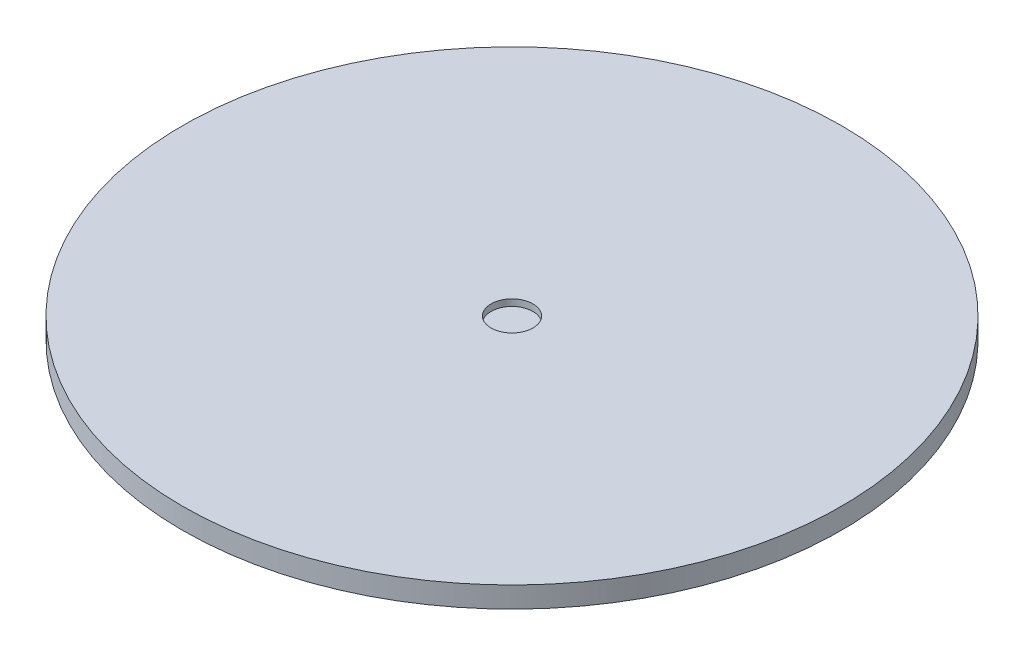
ISO-10303-21;
HEADER;
FILE_DESCRIPTION(('STEP AP214'),'2;1');
FILE_NAME('part.step','',(''),(''),'','','');
FILE_SCHEMA(('AUTOMOTIVE_DESIGN { 1 0 10303 214 1 1 1 1 }'));
ENDSEC;
DATA;
#1=APPLICATION_CONTEXT('core data for automotive mechanical design processes');
#2=APPLICATION_PROTOCOL_DEFINITION('international standard','automotive_design',2000,#1);
#3=PRODUCT_CONTEXT('',#1,'mechanical');
#4=PRODUCT('Part','Part','',(#3));
#5=PRODUCT_RELATED_PRODUCT_CATEGORY('part','',(#4));
#6=PRODUCT_DEFINITION_FORMATION('','',#4);
#7=PRODUCT_DEFINITION_CONTEXT('part definition',#1,'design');
#8=PRODUCT_DEFINITION('design','',#6,#7);
#9=PRODUCT_DEFINITION_SHAPE('','',#8);
#10=(LENGTH_UNIT() NAMED_UNIT(*) SI_UNIT(.MILLI.,.METRE.));
#11=(NAMED_UNIT(*) PLANE_ANGLE_UNIT() SI_UNIT($,.RADIAN.));
#12=(NAMED_UNIT(*) SI_UNIT($,.STERADIAN.) SOLID_ANGLE_UNIT());
#13=UNCERTAINTY_MEASURE_WITH_UNIT(LENGTH_MEASURE(1.E-05),#10,'distance_accuracy_value','');
#14=(GEOMETRIC_REPRESENTATION_CONTEXT(3) GLOBAL_UNCERTAINTY_ASSIGNED_CONTEXT((#13)) GLOBAL_UNIT_ASSIGNED_CONTEXT((#10,
#11,#12)) REPRESENTATION_CONTEXT('',''));
#15=CARTESIAN_POINT('',(0.,0.,0.));
#16=DIRECTION('',(0.,0.,1.));
#17=DIRECTION('',(1.,0.,0.));
#18=AXIS2_PLACEMENT_3D('',#15,#16,#17);
#19=CARTESIAN_POINT('',(0.,6.35,0.));
#20=DIRECTION('',(0.,-1.,0.));
#21=DIRECTION('',(0.,0.,-1.));
#22=AXIS2_PLACEMENT_3D('',#19,#20,#21);
#23=CYLINDRICAL_SURFACE('',#22,100.);
#24=CARTESIAN_POINT('',(0.,6.35,0.));
#25=DIRECTION('',(0.,1.,0.));
#26=DIRECTION('',(0.,0.,1.));
#27=AXIS2_PLACEMENT_3D('',#24,#25,#26);
#28=CIRCLE('',#27,100.);
#29=CARTESIAN_POINT('',(0.,6.35,100.));
#30=VERTEX_POINT('',#29);
#31=EDGE_CURVE('E10',#30,#30,#28,.T.);
#32=ORIENTED_EDGE('',*,*,#31,.F.);
#33=EDGE_LOOP('',(#32));
#34=FACE_BOUND('',#33,.T.);
#35=CARTESIAN_POINT('',(0.,0.,0.));
#36=DIRECTION('',(0.,1.,0.));
#37=DIRECTION('',(0.,0.,1.));
#38=AXIS2_PLACEMENT_3D('',#35,#36,#37);
#39=CIRCLE('',#38,100.);
#40=CARTESIAN_POINT('',(0.,0.,100.));
#41=VERTEX_POINT('',#40);
#42=EDGE_CURVE('E40',#41,#41,#39,.T.);
#43=ORIENTED_EDGE('',*,*,#42,.T.);
#44=EDGE_LOOP('',(#43));
#45=FACE_BOUND('',#44,.T.);
#46=ADVANCED_FACE('F37',(#34,#45),#23,.T.);
#47=CARTESIAN_POINT('',(0.,6.35,0.));
#48=DIRECTION('',(0.,1.,0.));
#49=DIRECTION('',(0.,0.,1.));
#50=AXIS2_PLACEMENT_3D('',#47,#48,#49);
#51=PLANE('',#50);
#52=CARTESIAN_POINT('',(0.,6.35,0.));
#53=DIRECTION('',(0.,1.,0.));
#54=DIRECTION('',(0.,0.,1.));
#55=AXIS2_PLACEMENT_3D('',#52,#53,#54);
#56=CIRCLE('',#55,6.35);
#57=CARTESIAN_POINT('',(0.,6.35,6.35));
#58=VERTEX_POINT('',#57);
#59=EDGE_CURVE('E51',#58,#58,#56,.T.);
#60=ORIENTED_EDGE('',*,*,#59,.F.);
#61=EDGE_LOOP('',(#60));
#62=FACE_BOUND('',#61,.T.);
#63=ORIENTED_EDGE('',*,*,#31,.T.);
#64=EDGE_LOOP('',(#63));
#65=FACE_BOUND('',#64,.T.);
#66=ADVANCED_FACE('F68',(#62,#65),#51,.T.);
#67=CARTESIAN_POINT('',(0.,0.,0.));
#68=DIRECTION('',(0.,1.,0.));
#69=DIRECTION('',(0.,0.,1.));
#70=AXIS2_PLACEMENT_3D('',#67,#68,#69);
#71=PLANE('',#70);
#72=ORIENTED_EDGE('',*,*,#42,.F.);
#73=EDGE_LOOP('',(#72));
#74=FACE_BOUND('',#73,.T.);
#75=ADVANCED_FACE('F64',(#74),#71,.F.);
#76=CARTESIAN_POINT('',(0.,4.35,0.));
#77=DIRECTION('',(0.,1.,0.));
#78=DIRECTION('',(0.,0.,1.));
#79=AXIS2_PLACEMENT_3D('',#76,#77,#78);
#80=CYLINDRICAL_SURFACE('',#79,6.35);
#81=CARTESIAN_POINT('',(0.,4.35,0.));
#82=DIRECTION('',(0.,1.,0.));
#83=DIRECTION('',(0.,0.,1.));
#84=AXIS2_PLACEMENT_3D('',#81,#82,#83);
#85=CIRCLE('',#84,6.35);
#86=CARTESIAN_POINT('',(0.,4.35,6.35));
#87=VERTEX_POINT('',#86);
#88=EDGE_CURVE('E49',#87,#87,#85,.T.);
#89=ORIENTED_EDGE('',*,*,#88,.F.);
#90=EDGE_LOOP('',(#89));
#91=FACE_BOUND('',#90,.T.);
#92=ORIENTED_EDGE('',*,*,#59,.T.);
#93=EDGE_LOOP('',(#92));
#94=FACE_BOUND('',#93,.T.);
#95=ADVANCED_FACE('F61',(#91,#94),#80,.F.);
#96=CARTESIAN_POINT('',(0.,4.35,0.));
#97=DIRECTION('',(0.,1.,0.));
#98=DIRECTION('',(0.,0.,1.));
#99=AXIS2_PLACEMENT_3D('',#96,#97,#98);
#100=PLANE('',#99);
#101=ORIENTED_EDGE('',*,*,#88,.T.);
#102=EDGE_LOOP('',(#101));
#103=FACE_BOUND('',#102,.T.);
#104=ADVANCED_FACE('F59',(#103),#100,.T.);
#105=CLOSED_SHELL('',(#46,#66,#75,#95,#104));
#106=MANIFOLD_SOLID_BREP('B2',#105);
#107=ADVANCED_BREP_SHAPE_REPRESENTATION('',(#18,#106),#14);
#108=SHAPE_DEFINITION_REPRESENTATION(#9,#107);
ENDSEC;
END-ISO-10303-21;
